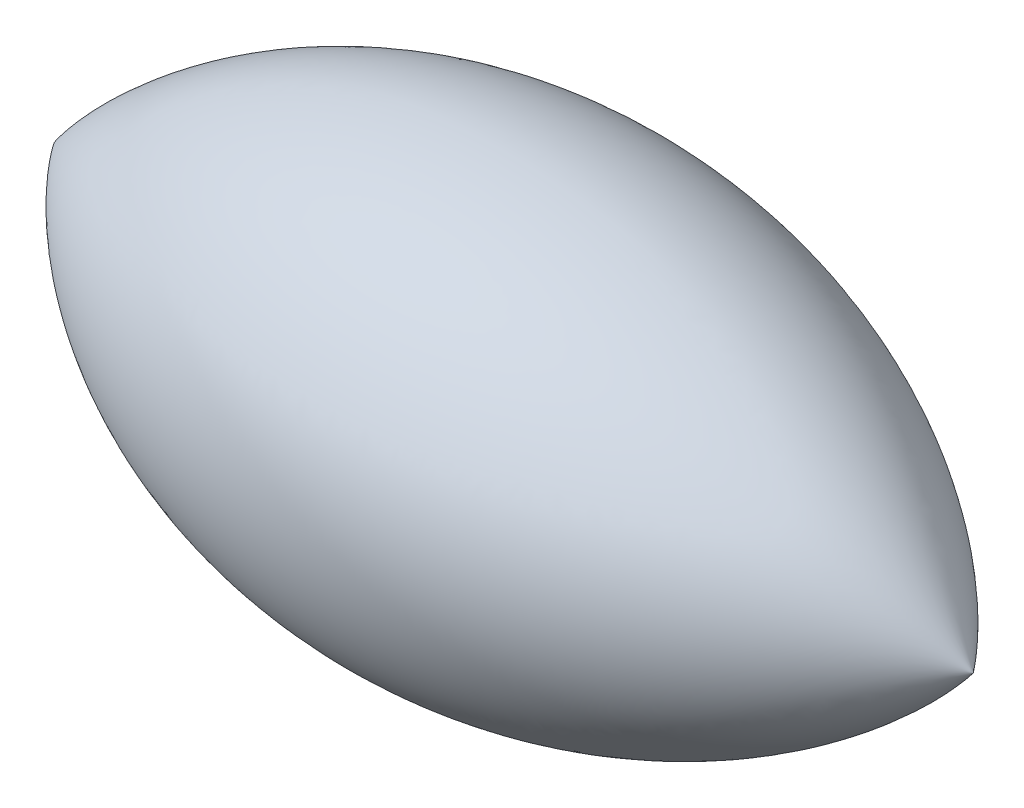
ISO-10303-21;
HEADER;
FILE_DESCRIPTION(('STEP AP214'),'2;1');
FILE_NAME('part.step','',(''),(''),'','','');
FILE_SCHEMA(('AUTOMOTIVE_DESIGN { 1 0 10303 214 1 1 1 1 }'));
ENDSEC;
DATA;
#1=APPLICATION_CONTEXT('core data for automotive mechanical design processes');
#2=APPLICATION_PROTOCOL_DEFINITION('international standard','automotive_design',2000,#1);
#3=PRODUCT_CONTEXT('',#1,'mechanical');
#4=PRODUCT('Part','Part','',(#3));
#5=PRODUCT_RELATED_PRODUCT_CATEGORY('part','',(#4));
#6=PRODUCT_DEFINITION_FORMATION('','',#4);
#7=PRODUCT_DEFINITION_CONTEXT('part definition',#1,'design');
#8=PRODUCT_DEFINITION('design','',#6,#7);
#9=PRODUCT_DEFINITION_SHAPE('','',#8);
#10=(LENGTH_UNIT() NAMED_UNIT(*) SI_UNIT(.MILLI.,.METRE.));
#11=(NAMED_UNIT(*) PLANE_ANGLE_UNIT() SI_UNIT($,.RADIAN.));
#12=(NAMED_UNIT(*) SI_UNIT($,.STERADIAN.) SOLID_ANGLE_UNIT());
#13=UNCERTAINTY_MEASURE_WITH_UNIT(LENGTH_MEASURE(1.E-05),#10,'distance_accuracy_value','');
#14=(GEOMETRIC_REPRESENTATION_CONTEXT(3) GLOBAL_UNCERTAINTY_ASSIGNED_CONTEXT((#13)) GLOBAL_UNIT_ASSIGNED_CONTEXT((#10,
#11,#12)) REPRESENTATION_CONTEXT('',''));
#15=CARTESIAN_POINT('',(0.,0.,0.));
#16=DIRECTION('',(0.,0.,1.));
#17=DIRECTION('',(1.,0.,0.));
#18=AXIS2_PLACEMENT_3D('',#15,#16,#17);
#19=CARTESIAN_POINT('',(451.481014066346,142.961048382594,0.));
#20=CARTESIAN_POINT('',(237.057590631081,411.039107210315,0.));
#21=CARTESIAN_POINT('',(-209.010294925933,427.717688684154,0.));
#22=CARTESIAN_POINT('',(-419.65765267058,142.961048382594,0.));
#23=B_SPLINE_CURVE_WITH_KNOTS('',3,(#19,#20,#21,#22),.UNSPECIFIED.,.F.,.F.,(4,4),(0.,1.),.UNSPECIFIED.);
#24=CARTESIAN_POINT('',(-419.65765267058,142.961048382594,0.));
#25=DIRECTION('',(-1.,0.,0.));
#26=AXIS1_PLACEMENT('',#24,#25);
#27=SURFACE_OF_REVOLUTION('',#23,#26);
#28=CARTESIAN_POINT('',(-419.65765267058,142.961048382594,0.));
#29=VERTEX_POINT('',#28);
#30=VERTEX_LOOP('',#29);
#31=FACE_BOUND('',#30,.T.);
#32=CARTESIAN_POINT('',(451.481014066346,142.961048382594,0.));
#33=VERTEX_POINT('',#32);
#34=VERTEX_LOOP('',#33);
#35=FACE_BOUND('',#34,.T.);
#36=ADVANCED_FACE('F40',(#31,#35),#27,.T.);
#37=CLOSED_SHELL('',(#36));
#38=MANIFOLD_SOLID_BREP('B2',#37);
#39=ADVANCED_BREP_SHAPE_REPRESENTATION('',(#18,#38),#14);
#40=SHAPE_DEFINITION_REPRESENTATION(#9,#39);
ENDSEC;
END-ISO-10303-21;
